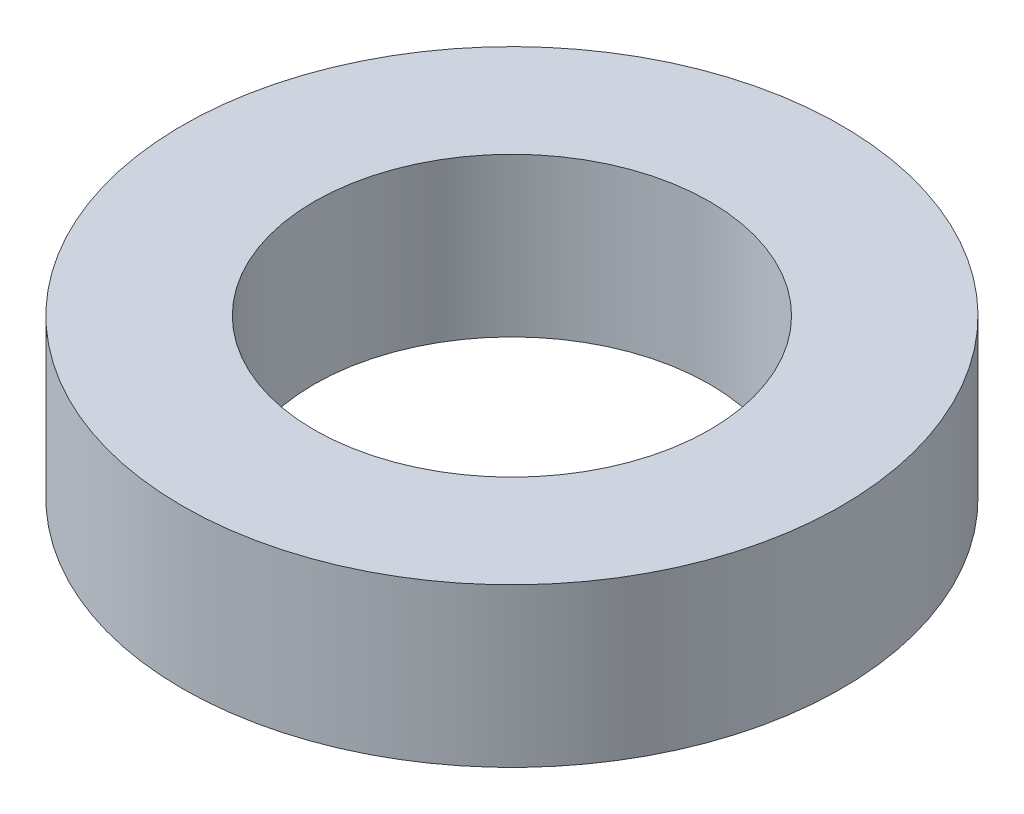
ISO-10303-21;
HEADER;
FILE_DESCRIPTION(('STEP AP214'),'2;1');
FILE_NAME('part.step','',(''),(''),'','','');
FILE_SCHEMA(('AUTOMOTIVE_DESIGN { 1 0 10303 214 1 1 1 1 }'));
ENDSEC;
DATA;
#1=APPLICATION_CONTEXT('core data for automotive mechanical design processes');
#2=APPLICATION_PROTOCOL_DEFINITION('international standard','automotive_design',2000,#1);
#3=PRODUCT_CONTEXT('',#1,'mechanical');
#4=PRODUCT('Part','Part','',(#3));
#5=PRODUCT_RELATED_PRODUCT_CATEGORY('part','',(#4));
#6=PRODUCT_DEFINITION_FORMATION('','',#4);
#7=PRODUCT_DEFINITION_CONTEXT('part definition',#1,'design');
#8=PRODUCT_DEFINITION('design','',#6,#7);
#9=PRODUCT_DEFINITION_SHAPE('','',#8);
#10=(LENGTH_UNIT() NAMED_UNIT(*) SI_UNIT(.MILLI.,.METRE.));
#11=(NAMED_UNIT(*) PLANE_ANGLE_UNIT() SI_UNIT($,.RADIAN.));
#12=(NAMED_UNIT(*) SI_UNIT($,.STERADIAN.) SOLID_ANGLE_UNIT());
#13=UNCERTAINTY_MEASURE_WITH_UNIT(LENGTH_MEASURE(1.E-05),#10,'distance_accuracy_value','');
#14=(GEOMETRIC_REPRESENTATION_CONTEXT(3) GLOBAL_UNCERTAINTY_ASSIGNED_CONTEXT((#13)) GLOBAL_UNIT_ASSIGNED_CONTEXT((#10,
#11,#12)) REPRESENTATION_CONTEXT('',''));
#15=CARTESIAN_POINT('',(0.,0.,0.));
#16=DIRECTION('',(0.,0.,1.));
#17=DIRECTION('',(1.,0.,0.));
#18=AXIS2_PLACEMENT_3D('',#15,#16,#17);
#19=CARTESIAN_POINT('',(0.,3.81,0.));
#20=DIRECTION('',(0.,1.,0.));
#21=DIRECTION('',(0.,0.,1.));
#22=AXIS2_PLACEMENT_3D('',#19,#20,#21);
#23=PLANE('',#22);
#24=CARTESIAN_POINT('',(0.,3.81,0.));
#25=DIRECTION('',(0.,1.,0.));
#26=DIRECTION('',(0.,0.,1.));
#27=AXIS2_PLACEMENT_3D('',#24,#25,#26);
#28=CIRCLE('',#27,7.9375);
#29=CARTESIAN_POINT('',(0.,3.81,7.9375));
#30=VERTEX_POINT('',#29);
#31=EDGE_CURVE('E10',#30,#30,#28,.T.);
#32=ORIENTED_EDGE('',*,*,#31,.T.);
#33=EDGE_LOOP('',(#32));
#34=FACE_BOUND('',#33,.T.);
#35=CARTESIAN_POINT('',(0.,3.81,0.));
#36=DIRECTION('',(0.,1.,0.));
#37=DIRECTION('',(0.,0.,1.));
#38=AXIS2_PLACEMENT_3D('',#35,#36,#37);
#39=CIRCLE('',#38,4.7625);
#40=CARTESIAN_POINT('',(0.,3.81,4.7625));
#41=VERTEX_POINT('',#40);
#42=EDGE_CURVE('E42',#41,#41,#39,.T.);
#43=ORIENTED_EDGE('',*,*,#42,.F.);
#44=EDGE_LOOP('',(#43));
#45=FACE_BOUND('',#44,.T.);
#46=ADVANCED_FACE('F31',(#34,#45),#23,.T.);
#47=CARTESIAN_POINT('',(0.,0.,0.));
#48=DIRECTION('',(0.,1.,0.));
#49=DIRECTION('',(0.,0.,1.));
#50=AXIS2_PLACEMENT_3D('',#47,#48,#49);
#51=PLANE('',#50);
#52=CARTESIAN_POINT('',(0.,0.,0.));
#53=DIRECTION('',(0.,1.,0.));
#54=DIRECTION('',(0.,0.,1.));
#55=AXIS2_PLACEMENT_3D('',#52,#53,#54);
#56=CIRCLE('',#55,7.9375);
#57=CARTESIAN_POINT('',(0.,0.,7.9375));
#58=VERTEX_POINT('',#57);
#59=EDGE_CURVE('E35',#58,#58,#56,.T.);
#60=ORIENTED_EDGE('',*,*,#59,.F.);
#61=EDGE_LOOP('',(#60));
#62=FACE_BOUND('',#61,.T.);
#63=CARTESIAN_POINT('',(0.,0.,0.));
#64=DIRECTION('',(0.,1.,0.));
#65=DIRECTION('',(0.,0.,1.));
#66=AXIS2_PLACEMENT_3D('',#63,#64,#65);
#67=CIRCLE('',#66,4.7625);
#68=CARTESIAN_POINT('',(0.,0.,4.7625));
#69=VERTEX_POINT('',#68);
#70=EDGE_CURVE('E44',#69,#69,#67,.T.);
#71=ORIENTED_EDGE('',*,*,#70,.T.);
#72=EDGE_LOOP('',(#71));
#73=FACE_BOUND('',#72,.T.);
#74=ADVANCED_FACE('F54',(#62,#73),#51,.F.);
#75=CARTESIAN_POINT('',(0.,3.81,0.));
#76=DIRECTION('',(0.,-1.,0.));
#77=DIRECTION('',(0.,0.,-1.));
#78=AXIS2_PLACEMENT_3D('',#75,#76,#77);
#79=CYLINDRICAL_SURFACE('',#78,7.9375);
#80=ORIENTED_EDGE('',*,*,#31,.F.);
#81=EDGE_LOOP('',(#80));
#82=FACE_BOUND('',#81,.T.);
#83=ORIENTED_EDGE('',*,*,#59,.T.);
#84=EDGE_LOOP('',(#83));
#85=FACE_BOUND('',#84,.T.);
#86=ADVANCED_FACE('F33',(#82,#85),#79,.T.);
#87=CARTESIAN_POINT('',(0.,3.81,0.));
#88=DIRECTION('',(0.,-1.,0.));
#89=DIRECTION('',(0.,0.,-1.));
#90=AXIS2_PLACEMENT_3D('',#87,#88,#89);
#91=CYLINDRICAL_SURFACE('',#90,4.7625);
#92=ORIENTED_EDGE('',*,*,#42,.T.);
#93=EDGE_LOOP('',(#92));
#94=FACE_BOUND('',#93,.T.);
#95=ORIENTED_EDGE('',*,*,#70,.F.);
#96=EDGE_LOOP('',(#95));
#97=FACE_BOUND('',#96,.T.);
#98=ADVANCED_FACE('F50',(#94,#97),#91,.F.);
#99=CLOSED_SHELL('',(#46,#74,#86,#98));
#100=MANIFOLD_SOLID_BREP('B2',#99);
#101=ADVANCED_BREP_SHAPE_REPRESENTATION('',(#18,#100),#14);
#102=SHAPE_DEFINITION_REPRESENTATION(#9,#101);
ENDSEC;
END-ISO-10303-21;
